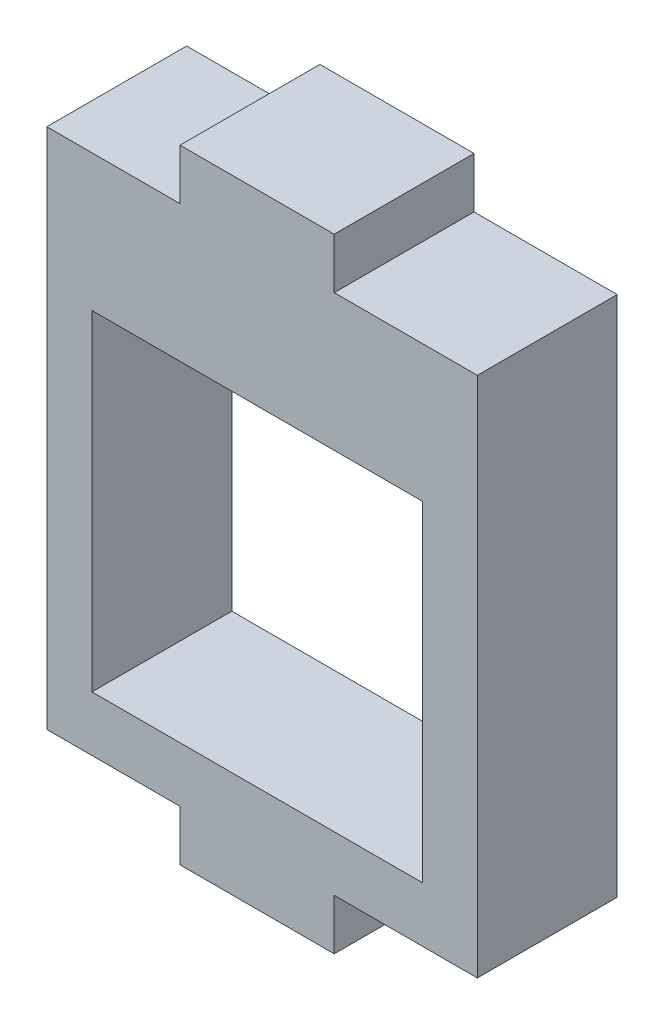
ISO-10303-21;
HEADER;
FILE_DESCRIPTION(('STEP AP214'),'2;1');
FILE_NAME('part.step','',(''),(''),'','','');
FILE_SCHEMA(('AUTOMOTIVE_DESIGN { 1 0 10303 214 1 1 1 1 }'));
ENDSEC;
DATA;
#1=APPLICATION_CONTEXT('core data for automotive mechanical design processes');
#2=APPLICATION_PROTOCOL_DEFINITION('international standard','automotive_design',2000,#1);
#3=PRODUCT_CONTEXT('',#1,'mechanical');
#4=PRODUCT('Part','Part','',(#3));
#5=PRODUCT_RELATED_PRODUCT_CATEGORY('part','',(#4));
#6=PRODUCT_DEFINITION_FORMATION('','',#4);
#7=PRODUCT_DEFINITION_CONTEXT('part definition',#1,'design');
#8=PRODUCT_DEFINITION('design','',#6,#7);
#9=PRODUCT_DEFINITION_SHAPE('','',#8);
#10=(LENGTH_UNIT() NAMED_UNIT(*) SI_UNIT(.MILLI.,.METRE.));
#11=(NAMED_UNIT(*) PLANE_ANGLE_UNIT() SI_UNIT($,.RADIAN.));
#12=(NAMED_UNIT(*) SI_UNIT($,.STERADIAN.) SOLID_ANGLE_UNIT());
#13=UNCERTAINTY_MEASURE_WITH_UNIT(LENGTH_MEASURE(1.E-05),#10,'distance_accuracy_value','');
#14=(GEOMETRIC_REPRESENTATION_CONTEXT(3) GLOBAL_UNCERTAINTY_ASSIGNED_CONTEXT((#13)) GLOBAL_UNIT_ASSIGNED_CONTEXT((#10,
#11,#12)) REPRESENTATION_CONTEXT('',''));
#15=CARTESIAN_POINT('',(0.,0.,0.));
#16=DIRECTION('',(0.,0.,1.));
#17=DIRECTION('',(1.,0.,0.));
#18=AXIS2_PLACEMENT_3D('',#15,#16,#17);
#19=CARTESIAN_POINT('',(2.26470070803342,0.383619426620352,6.35));
#20=DIRECTION('',(0.,1.,0.));
#21=DIRECTION('',(-1.,0.,0.));
#22=AXIS2_PLACEMENT_3D('',#19,#20,#21);
#23=PLANE('',#22);
#24=DIRECTION('',(0.,0.,1.));
#25=VECTOR('',#24,1.);
#26=CARTESIAN_POINT('',(-4.23529929196658,0.383619426620351,0.));
#27=LINE('',#26,#25);
#28=CARTESIAN_POINT('',(-4.23529929196658,0.383619426620351,0.));
#29=VERTEX_POINT('',#28);
#30=CARTESIAN_POINT('',(-4.23529929196658,0.383619426620351,6.35));
#31=VERTEX_POINT('',#30);
#32=EDGE_CURVE('E298',#29,#31,#27,.T.);
#33=ORIENTED_EDGE('',*,*,#32,.F.);
#34=DIRECTION('',(1.,0.,0.));
#35=VECTOR('',#34,1.);
#36=CARTESIAN_POINT('',(2.26470070803342,0.383619426620352,0.));
#37=LINE('',#36,#35);
#38=CARTESIAN_POINT('',(2.26470070803342,0.383619426620352,0.));
#39=VERTEX_POINT('',#38);
#40=EDGE_CURVE('E187',#29,#39,#37,.T.);
#41=ORIENTED_EDGE('',*,*,#40,.T.);
#42=DIRECTION('',(0.,0.,-1.));
#43=VECTOR('',#42,1.);
#44=CARTESIAN_POINT('',(2.26470070803342,0.383619426620352,6.35));
#45=LINE('',#44,#43);
#46=CARTESIAN_POINT('',(2.26470070803342,0.383619426620352,6.35));
#47=VERTEX_POINT('',#46);
#48=EDGE_CURVE('E48',#47,#39,#45,.T.);
#49=ORIENTED_EDGE('',*,*,#48,.F.);
#50=DIRECTION('',(1.,0.,0.));
#51=VECTOR('',#50,1.);
#52=CARTESIAN_POINT('',(2.26470070803342,0.383619426620352,6.35));
#53=LINE('',#52,#51);
#54=EDGE_CURVE('E169',#31,#47,#53,.T.);
#55=ORIENTED_EDGE('',*,*,#54,.F.);
#56=EDGE_LOOP('',(#33,#41,#49,#55));
#57=FACE_BOUND('',#56,.T.);
#58=ADVANCED_FACE('F40',(#57),#23,.F.);
#59=CARTESIAN_POINT('',(-17.2852992919666,0.383619426620351,6.35));
#60=VERTEX_POINT('',#59);
#61=CARTESIAN_POINT('',(-11.2352992919666,0.383619426620351,6.35));
#62=VERTEX_POINT('',#61);
#63=EDGE_CURVE('E61',#60,#62,#53,.T.);
#64=ORIENTED_EDGE('',*,*,#63,.F.);
#65=DIRECTION('',(0.,0.,1.));
#66=VECTOR('',#65,1.);
#67=CARTESIAN_POINT('',(-17.2852992919666,0.383619426620351,-3.65));
#68=LINE('',#67,#66);
#69=CARTESIAN_POINT('',(-17.2852992919666,0.383619426620351,0.));
#70=VERTEX_POINT('',#69);
#71=EDGE_CURVE('E151',#70,#60,#68,.T.);
#72=ORIENTED_EDGE('',*,*,#71,.F.);
#73=CARTESIAN_POINT('',(-11.2352992919666,0.383619426620351,0.));
#74=VERTEX_POINT('',#73);
#75=EDGE_CURVE('E184',#70,#74,#37,.T.);
#76=ORIENTED_EDGE('',*,*,#75,.T.);
#77=DIRECTION('',(0.,0.,1.));
#78=VECTOR('',#77,1.);
#79=CARTESIAN_POINT('',(-11.2352992919666,0.383619426620351,0.));
#80=LINE('',#79,#78);
#81=EDGE_CURVE('E167',#74,#62,#80,.T.);
#82=ORIENTED_EDGE('',*,*,#81,.T.);
#83=EDGE_LOOP('',(#64,#72,#76,#82));
#84=FACE_BOUND('',#83,.T.);
#85=ADVANCED_FACE('F42',(#84),#23,.F.);
#86=CARTESIAN_POINT('',(2.26470070803342,17.8836194266204,6.35));
#87=DIRECTION('',(-1.,0.,0.));
#88=DIRECTION('',(0.,-1.,0.));
#89=AXIS2_PLACEMENT_3D('',#86,#87,#88);
#90=PLANE('',#89);
#91=DIRECTION('',(0.,1.,0.));
#92=VECTOR('',#91,1.);
#93=CARTESIAN_POINT('',(2.26470070803342,17.8836194266204,0.));
#94=LINE('',#93,#92);
#95=CARTESIAN_POINT('',(2.26470070803342,24.0836194266204,0.));
#96=VERTEX_POINT('',#95);
#97=EDGE_CURVE('E186',#39,#96,#94,.T.);
#98=ORIENTED_EDGE('',*,*,#97,.T.);
#99=DIRECTION('',(0.,0.,1.));
#100=VECTOR('',#99,1.);
#101=CARTESIAN_POINT('',(2.26470070803342,24.0836194266204,0.));
#102=LINE('',#101,#100);
#103=CARTESIAN_POINT('',(2.26470070803342,24.0836194266204,6.35));
#104=VERTEX_POINT('',#103);
#105=EDGE_CURVE('E244',#96,#104,#102,.T.);
#106=ORIENTED_EDGE('',*,*,#105,.T.);
#107=DIRECTION('',(0.,1.,0.));
#108=VECTOR('',#107,1.);
#109=CARTESIAN_POINT('',(2.26470070803342,17.8836194266204,6.35));
#110=LINE('',#109,#108);
#111=EDGE_CURVE('E168',#47,#104,#110,.T.);
#112=ORIENTED_EDGE('',*,*,#111,.F.);
#113=ORIENTED_EDGE('',*,*,#48,.T.);
#114=EDGE_LOOP('',(#98,#106,#112,#113));
#115=FACE_BOUND('',#114,.T.);
#116=ADVANCED_FACE('F209',(#115),#90,.F.);
#117=CARTESIAN_POINT('',(-0.235299291966581,2.88361942662035,6.35));
#118=DIRECTION('',(1.,0.,0.));
#119=DIRECTION('',(0.,0.,-1.));
#120=AXIS2_PLACEMENT_3D('',#117,#118,#119);
#121=PLANE('',#120);
#122=DIRECTION('',(0.,-1.,0.));
#123=VECTOR('',#122,1.);
#124=CARTESIAN_POINT('',(-0.235299291966581,2.88361942662035,0.));
#125=LINE('',#124,#123);
#126=CARTESIAN_POINT('',(-0.235299291966581,17.8836194266204,0.));
#127=VERTEX_POINT('',#126);
#128=CARTESIAN_POINT('',(-0.235299291966581,2.88361942662035,0.));
#129=VERTEX_POINT('',#128);
#130=EDGE_CURVE('E189',#127,#129,#125,.T.);
#131=ORIENTED_EDGE('',*,*,#130,.T.);
#132=DIRECTION('',(0.,0.,-1.));
#133=VECTOR('',#132,1.);
#134=CARTESIAN_POINT('',(-0.235299291966581,2.88361942662035,6.35));
#135=LINE('',#134,#133);
#136=CARTESIAN_POINT('',(-0.235299291966581,2.88361942662035,6.35));
#137=VERTEX_POINT('',#136);
#138=EDGE_CURVE('E199',#137,#129,#135,.T.);
#139=ORIENTED_EDGE('',*,*,#138,.F.);
#140=DIRECTION('',(0.,-1.,0.));
#141=VECTOR('',#140,1.);
#142=CARTESIAN_POINT('',(-0.235299291966581,2.88361942662035,6.35));
#143=LINE('',#142,#141);
#144=CARTESIAN_POINT('',(-0.235299291966581,17.8836194266204,6.35));
#145=VERTEX_POINT('',#144);
#146=EDGE_CURVE('E171',#145,#137,#143,.T.);
#147=ORIENTED_EDGE('',*,*,#146,.F.);
#148=DIRECTION('',(0.,0.,-1.));
#149=VECTOR('',#148,1.);
#150=CARTESIAN_POINT('',(-0.235299291966581,17.8836194266204,6.35));
#151=LINE('',#150,#149);
#152=EDGE_CURVE('E202',#145,#127,#151,.T.);
#153=ORIENTED_EDGE('',*,*,#152,.T.);
#154=EDGE_LOOP('',(#131,#139,#147,#153));
#155=FACE_BOUND('',#154,.T.);
#156=ADVANCED_FACE('F276',(#155),#121,.F.);
#157=CARTESIAN_POINT('',(-15.2352992919666,2.88361942662035,6.35));
#158=DIRECTION('',(0.,-1.,0.));
#159=DIRECTION('',(1.,0.,0.));
#160=AXIS2_PLACEMENT_3D('',#157,#158,#159);
#161=PLANE('',#160);
#162=DIRECTION('',(-1.,0.,0.));
#163=VECTOR('',#162,1.);
#164=CARTESIAN_POINT('',(-15.2352992919666,2.88361942662035,0.));
#165=LINE('',#164,#163);
#166=CARTESIAN_POINT('',(-15.2352992919666,2.88361942662035,0.));
#167=VERTEX_POINT('',#166);
#168=EDGE_CURVE('E191',#129,#167,#165,.T.);
#169=ORIENTED_EDGE('',*,*,#168,.T.);
#170=DIRECTION('',(0.,0.,-1.));
#171=VECTOR('',#170,1.);
#172=CARTESIAN_POINT('',(-15.2352992919666,2.88361942662035,6.35));
#173=LINE('',#172,#171);
#174=CARTESIAN_POINT('',(-15.2352992919666,2.88361942662035,6.35));
#175=VERTEX_POINT('',#174);
#176=EDGE_CURVE('E196',#175,#167,#173,.T.);
#177=ORIENTED_EDGE('',*,*,#176,.F.);
#178=DIRECTION('',(-1.,0.,0.));
#179=VECTOR('',#178,1.);
#180=CARTESIAN_POINT('',(-15.2352992919666,2.88361942662035,6.35));
#181=LINE('',#180,#179);
#182=EDGE_CURVE('E179',#137,#175,#181,.T.);
#183=ORIENTED_EDGE('',*,*,#182,.F.);
#184=ORIENTED_EDGE('',*,*,#138,.T.);
#185=EDGE_LOOP('',(#169,#177,#183,#184));
#186=FACE_BOUND('',#185,.T.);
#187=ADVANCED_FACE('F281',(#186),#161,.F.);
#188=CARTESIAN_POINT('',(-15.2352992919666,17.8836194266204,6.35));
#189=DIRECTION('',(-1.,0.,0.));
#190=DIRECTION('',(0.,-1.,0.));
#191=AXIS2_PLACEMENT_3D('',#188,#189,#190);
#192=PLANE('',#191);
#193=DIRECTION('',(0.,1.,0.));
#194=VECTOR('',#193,1.);
#195=CARTESIAN_POINT('',(-15.2352992919666,17.8836194266204,0.));
#196=LINE('',#195,#194);
#197=CARTESIAN_POINT('',(-15.2352992919666,17.8836194266204,0.));
#198=VERTEX_POINT('',#197);
#199=EDGE_CURVE('E173',#167,#198,#196,.T.);
#200=ORIENTED_EDGE('',*,*,#199,.T.);
#201=DIRECTION('',(0.,0.,-1.));
#202=VECTOR('',#201,1.);
#203=CARTESIAN_POINT('',(-15.2352992919666,17.8836194266204,6.35));
#204=LINE('',#203,#202);
#205=CARTESIAN_POINT('',(-15.2352992919666,17.8836194266204,6.35));
#206=VERTEX_POINT('',#205);
#207=EDGE_CURVE('E183',#206,#198,#204,.T.);
#208=ORIENTED_EDGE('',*,*,#207,.F.);
#209=DIRECTION('',(0.,1.,0.));
#210=VECTOR('',#209,1.);
#211=CARTESIAN_POINT('',(-15.2352992919666,17.8836194266204,6.35));
#212=LINE('',#211,#210);
#213=EDGE_CURVE('E181',#175,#206,#212,.T.);
#214=ORIENTED_EDGE('',*,*,#213,.F.);
#215=ORIENTED_EDGE('',*,*,#176,.T.);
#216=EDGE_LOOP('',(#200,#208,#214,#215));
#217=FACE_BOUND('',#216,.T.);
#218=ADVANCED_FACE('F283',(#217),#192,.F.);
#219=CARTESIAN_POINT('',(0.,0.,6.35));
#220=DIRECTION('',(0.,0.,-1.));
#221=DIRECTION('',(-1.,0.,0.));
#222=AXIS2_PLACEMENT_3D('',#219,#220,#221);
#223=PLANE('',#222);
#224=DIRECTION('',(-1.,0.,0.));
#225=VECTOR('',#224,1.);
#226=CARTESIAN_POINT('',(-17.7352992919666,24.0836194266204,6.35));
#227=LINE('',#226,#225);
#228=CARTESIAN_POINT('',(-11.2352992919666,24.0836194266204,6.35));
#229=VERTEX_POINT('',#228);
#230=CARTESIAN_POINT('',(-17.2852992919666,24.0836194266204,6.35));
#231=VERTEX_POINT('',#230);
#232=EDGE_CURVE('E163',#229,#231,#227,.T.);
#233=ORIENTED_EDGE('',*,*,#232,.T.);
#234=DIRECTION('',(0.,1.,0.));
#235=VECTOR('',#234,1.);
#236=CARTESIAN_POINT('',(-17.2852992919666,24.0836194266204,6.35));
#237=LINE('',#236,#235);
#238=EDGE_CURVE('E54',#60,#231,#237,.T.);
#239=ORIENTED_EDGE('',*,*,#238,.F.);
#240=ORIENTED_EDGE('',*,*,#63,.T.);
#241=DIRECTION('',(0.,-1.,0.));
#242=VECTOR('',#241,1.);
#243=CARTESIAN_POINT('',(-11.2352992919666,0.383619426620351,6.35));
#244=LINE('',#243,#242);
#245=CARTESIAN_POINT('',(-11.2352992919666,-1.91638057337965,6.35));
#246=VERTEX_POINT('',#245);
#247=EDGE_CURVE('E312',#62,#246,#244,.T.);
#248=ORIENTED_EDGE('',*,*,#247,.T.);
#249=DIRECTION('',(1.,0.,0.));
#250=VECTOR('',#249,1.);
#251=CARTESIAN_POINT('',(-11.2352992919666,-1.91638057337965,6.35));
#252=LINE('',#251,#250);
#253=CARTESIAN_POINT('',(-4.23529929196658,-1.91638057337965,6.35));
#254=VERTEX_POINT('',#253);
#255=EDGE_CURVE('E309',#246,#254,#252,.T.);
#256=ORIENTED_EDGE('',*,*,#255,.T.);
#257=DIRECTION('',(0.,1.,0.));
#258=VECTOR('',#257,1.);
#259=CARTESIAN_POINT('',(-4.23529929196658,0.383619426620351,6.35));
#260=LINE('',#259,#258);
#261=EDGE_CURVE('E306',#254,#31,#260,.T.);
#262=ORIENTED_EDGE('',*,*,#261,.T.);
#263=ORIENTED_EDGE('',*,*,#54,.T.);
#264=ORIENTED_EDGE('',*,*,#111,.T.);
#265=DIRECTION('',(-1.,0.,0.));
#266=VECTOR('',#265,1.);
#267=CARTESIAN_POINT('',(-4.23529929196658,24.0836194266204,6.35));
#268=LINE('',#267,#266);
#269=CARTESIAN_POINT('',(-4.23529929196658,24.0836194266204,6.35));
#270=VERTEX_POINT('',#269);
#271=EDGE_CURVE('E245',#104,#270,#268,.T.);
#272=ORIENTED_EDGE('',*,*,#271,.T.);
#273=DIRECTION('',(0.,1.,0.));
#274=VECTOR('',#273,1.);
#275=CARTESIAN_POINT('',(-4.23529929196658,24.0836194266204,6.35));
#276=LINE('',#275,#274);
#277=CARTESIAN_POINT('',(-4.23529929196658,26.3836194266203,6.35));
#278=VERTEX_POINT('',#277);
#279=EDGE_CURVE('E248',#270,#278,#276,.T.);
#280=ORIENTED_EDGE('',*,*,#279,.T.);
#281=DIRECTION('',(-1.,0.,0.));
#282=VECTOR('',#281,1.);
#283=CARTESIAN_POINT('',(-11.2352992919666,26.3836194266203,6.35));
#284=LINE('',#283,#282);
#285=CARTESIAN_POINT('',(-11.2352992919666,26.3836194266203,6.35));
#286=VERTEX_POINT('',#285);
#287=EDGE_CURVE('E251',#278,#286,#284,.T.);
#288=ORIENTED_EDGE('',*,*,#287,.T.);
#289=DIRECTION('',(0.,-1.,0.));
#290=VECTOR('',#289,1.);
#291=CARTESIAN_POINT('',(-11.2352992919666,24.0836194266204,6.35));
#292=LINE('',#291,#290);
#293=EDGE_CURVE('E230',#286,#229,#292,.T.);
#294=ORIENTED_EDGE('',*,*,#293,.T.);
#295=EDGE_LOOP('',(#233,#239,#240,#248,#256,#262,#263,#264,#272,#280,#288,#294));
#296=FACE_BOUND('',#295,.T.);
#297=ORIENTED_EDGE('',*,*,#213,.T.);
#298=DIRECTION('',(1.,0.,0.));
#299=VECTOR('',#298,1.);
#300=CARTESIAN_POINT('',(-17.7352992919666,17.8836194266204,6.35));
#301=LINE('',#300,#299);
#302=EDGE_CURVE('E263',#206,#145,#301,.T.);
#303=ORIENTED_EDGE('',*,*,#302,.T.);
#304=ORIENTED_EDGE('',*,*,#146,.T.);
#305=ORIENTED_EDGE('',*,*,#182,.T.);
#306=EDGE_LOOP('',(#297,#303,#304,#305));
#307=FACE_BOUND('',#306,.T.);
#308=ADVANCED_FACE('F159',(#296,#307),#223,.F.);
#309=CARTESIAN_POINT('',(0.,0.,0.));
#310=DIRECTION('',(0.,0.,-1.));
#311=DIRECTION('',(-1.,0.,0.));
#312=AXIS2_PLACEMENT_3D('',#309,#310,#311);
#313=PLANE('',#312);
#314=DIRECTION('',(0.,-1.,0.));
#315=VECTOR('',#314,1.);
#316=CARTESIAN_POINT('',(-17.2852992919666,0.,0.));
#317=LINE('',#316,#315);
#318=CARTESIAN_POINT('',(-17.2852992919666,24.0836194266204,0.));
#319=VERTEX_POINT('',#318);
#320=EDGE_CURVE('E154',#319,#70,#317,.T.);
#321=ORIENTED_EDGE('',*,*,#320,.F.);
#322=DIRECTION('',(-1.,0.,0.));
#323=VECTOR('',#322,1.);
#324=CARTESIAN_POINT('',(-17.7352992919666,24.0836194266204,0.));
#325=LINE('',#324,#323);
#326=CARTESIAN_POINT('',(-11.2352992919666,24.0836194266204,0.));
#327=VERTEX_POINT('',#326);
#328=EDGE_CURVE('E241',#327,#319,#325,.T.);
#329=ORIENTED_EDGE('',*,*,#328,.F.);
#330=DIRECTION('',(0.,-1.,0.));
#331=VECTOR('',#330,1.);
#332=CARTESIAN_POINT('',(-11.2352992919666,24.0836194266204,0.));
#333=LINE('',#332,#331);
#334=CARTESIAN_POINT('',(-11.2352992919666,26.3836194266203,0.));
#335=VERTEX_POINT('',#334);
#336=EDGE_CURVE('E238',#335,#327,#333,.T.);
#337=ORIENTED_EDGE('',*,*,#336,.F.);
#338=DIRECTION('',(-1.,0.,0.));
#339=VECTOR('',#338,1.);
#340=CARTESIAN_POINT('',(-11.2352992919666,26.3836194266203,0.));
#341=LINE('',#340,#339);
#342=CARTESIAN_POINT('',(-4.23529929196658,26.3836194266203,0.));
#343=VERTEX_POINT('',#342);
#344=EDGE_CURVE('E228',#343,#335,#341,.T.);
#345=ORIENTED_EDGE('',*,*,#344,.F.);
#346=DIRECTION('',(0.,1.,0.));
#347=VECTOR('',#346,1.);
#348=CARTESIAN_POINT('',(-4.23529929196658,24.0836194266204,0.));
#349=LINE('',#348,#347);
#350=CARTESIAN_POINT('',(-4.23529929196658,24.0836194266204,0.));
#351=VERTEX_POINT('',#350);
#352=EDGE_CURVE('E225',#351,#343,#349,.T.);
#353=ORIENTED_EDGE('',*,*,#352,.F.);
#354=DIRECTION('',(-1.,0.,0.));
#355=VECTOR('',#354,1.);
#356=CARTESIAN_POINT('',(-4.23529929196658,24.0836194266204,0.));
#357=LINE('',#356,#355);
#358=EDGE_CURVE('E222',#96,#351,#357,.T.);
#359=ORIENTED_EDGE('',*,*,#358,.F.);
#360=ORIENTED_EDGE('',*,*,#97,.F.);
#361=ORIENTED_EDGE('',*,*,#40,.F.);
#362=DIRECTION('',(0.,1.,0.));
#363=VECTOR('',#362,1.);
#364=CARTESIAN_POINT('',(-4.23529929196658,0.383619426620351,0.));
#365=LINE('',#364,#363);
#366=CARTESIAN_POINT('',(-4.23529929196658,-1.91638057337965,0.));
#367=VERTEX_POINT('',#366);
#368=EDGE_CURVE('E314',#367,#29,#365,.T.);
#369=ORIENTED_EDGE('',*,*,#368,.F.);
#370=DIRECTION('',(1.,0.,0.));
#371=VECTOR('',#370,1.);
#372=CARTESIAN_POINT('',(-11.2352992919666,-1.91638057337965,0.));
#373=LINE('',#372,#371);
#374=CARTESIAN_POINT('',(-11.2352992919666,-1.91638057337965,0.));
#375=VERTEX_POINT('',#374);
#376=EDGE_CURVE('E316',#375,#367,#373,.T.);
#377=ORIENTED_EDGE('',*,*,#376,.F.);
#378=DIRECTION('',(0.,-1.,0.));
#379=VECTOR('',#378,1.);
#380=CARTESIAN_POINT('',(-11.2352992919666,0.383619426620351,0.));
#381=LINE('',#380,#379);
#382=EDGE_CURVE('E308',#74,#375,#381,.T.);
#383=ORIENTED_EDGE('',*,*,#382,.F.);
#384=ORIENTED_EDGE('',*,*,#75,.F.);
#385=EDGE_LOOP('',(#321,#329,#337,#345,#353,#359,#360,#361,#369,#377,#383,#384));
#386=FACE_BOUND('',#385,.T.);
#387=DIRECTION('',(1.,0.,0.));
#388=VECTOR('',#387,1.);
#389=CARTESIAN_POINT('',(-17.7352992919666,17.8836194266204,0.));
#390=LINE('',#389,#388);
#391=EDGE_CURVE('E175',#198,#127,#390,.T.);
#392=ORIENTED_EDGE('',*,*,#391,.F.);
#393=ORIENTED_EDGE('',*,*,#199,.F.);
#394=ORIENTED_EDGE('',*,*,#168,.F.);
#395=ORIENTED_EDGE('',*,*,#130,.F.);
#396=EDGE_LOOP('',(#392,#393,#394,#395));
#397=FACE_BOUND('',#396,.T.);
#398=ADVANCED_FACE('F217',(#386,#397),#313,.T.);
#399=CARTESIAN_POINT('',(-17.7352992919666,17.8836194266204,6.35));
#400=DIRECTION('',(0.,1.,0.));
#401=DIRECTION('',(0.,0.,1.));
#402=AXIS2_PLACEMENT_3D('',#399,#400,#401);
#403=PLANE('',#402);
#404=ORIENTED_EDGE('',*,*,#391,.T.);
#405=ORIENTED_EDGE('',*,*,#152,.F.);
#406=ORIENTED_EDGE('',*,*,#302,.F.);
#407=ORIENTED_EDGE('',*,*,#207,.T.);
#408=EDGE_LOOP('',(#404,#405,#406,#407));
#409=FACE_BOUND('',#408,.T.);
#410=ADVANCED_FACE('F270',(#409),#403,.F.);
#411=CARTESIAN_POINT('',(-17.7352992919666,24.0836194266204,0.));
#412=DIRECTION('',(0.,1.,0.));
#413=DIRECTION('',(0.,0.,1.));
#414=AXIS2_PLACEMENT_3D('',#411,#412,#413);
#415=PLANE('',#414);
#416=DIRECTION('',(0.,0.,-1.));
#417=VECTOR('',#416,1.);
#418=CARTESIAN_POINT('',(-17.2852992919666,24.0836194266204,0.));
#419=LINE('',#418,#417);
#420=EDGE_CURVE('E11',#231,#319,#419,.T.);
#421=ORIENTED_EDGE('',*,*,#420,.F.);
#422=ORIENTED_EDGE('',*,*,#232,.F.);
#423=DIRECTION('',(0.,0.,1.));
#424=VECTOR('',#423,1.);
#425=CARTESIAN_POINT('',(-11.2352992919666,24.0836194266204,0.));
#426=LINE('',#425,#424);
#427=EDGE_CURVE('E255',#327,#229,#426,.T.);
#428=ORIENTED_EDGE('',*,*,#427,.F.);
#429=ORIENTED_EDGE('',*,*,#328,.T.);
#430=EDGE_LOOP('',(#421,#422,#428,#429));
#431=FACE_BOUND('',#430,.T.);
#432=ADVANCED_FACE('F340',(#431),#415,.T.);
#433=CARTESIAN_POINT('',(-11.2352992919666,24.0836194266204,0.));
#434=DIRECTION('',(-1.,0.,0.));
#435=DIRECTION('',(0.,0.,1.));
#436=AXIS2_PLACEMENT_3D('',#433,#434,#435);
#437=PLANE('',#436);
#438=ORIENTED_EDGE('',*,*,#293,.F.);
#439=DIRECTION('',(0.,0.,1.));
#440=VECTOR('',#439,1.);
#441=CARTESIAN_POINT('',(-11.2352992919666,26.3836194266203,0.));
#442=LINE('',#441,#440);
#443=EDGE_CURVE('E257',#335,#286,#442,.T.);
#444=ORIENTED_EDGE('',*,*,#443,.F.);
#445=ORIENTED_EDGE('',*,*,#336,.T.);
#446=ORIENTED_EDGE('',*,*,#427,.T.);
#447=EDGE_LOOP('',(#438,#444,#445,#446));
#448=FACE_BOUND('',#447,.T.);
#449=ADVANCED_FACE('F343',(#448),#437,.T.);
#450=CARTESIAN_POINT('',(-11.2352992919666,26.3836194266203,0.));
#451=DIRECTION('',(0.,1.,0.));
#452=DIRECTION('',(0.,0.,1.));
#453=AXIS2_PLACEMENT_3D('',#450,#451,#452);
#454=PLANE('',#453);
#455=ORIENTED_EDGE('',*,*,#287,.F.);
#456=DIRECTION('',(0.,0.,1.));
#457=VECTOR('',#456,1.);
#458=CARTESIAN_POINT('',(-4.23529929196658,26.3836194266203,0.));
#459=LINE('',#458,#457);
#460=EDGE_CURVE('E259',#343,#278,#459,.T.);
#461=ORIENTED_EDGE('',*,*,#460,.F.);
#462=ORIENTED_EDGE('',*,*,#344,.T.);
#463=ORIENTED_EDGE('',*,*,#443,.T.);
#464=EDGE_LOOP('',(#455,#461,#462,#463));
#465=FACE_BOUND('',#464,.T.);
#466=ADVANCED_FACE('F347',(#465),#454,.T.);
#467=CARTESIAN_POINT('',(-4.23529929196658,24.0836194266204,0.));
#468=DIRECTION('',(1.,0.,0.));
#469=DIRECTION('',(0.,0.,-1.));
#470=AXIS2_PLACEMENT_3D('',#467,#468,#469);
#471=PLANE('',#470);
#472=ORIENTED_EDGE('',*,*,#279,.F.);
#473=DIRECTION('',(0.,0.,1.));
#474=VECTOR('',#473,1.);
#475=CARTESIAN_POINT('',(-4.23529929196658,24.0836194266204,0.));
#476=LINE('',#475,#474);
#477=EDGE_CURVE('E261',#351,#270,#476,.T.);
#478=ORIENTED_EDGE('',*,*,#477,.F.);
#479=ORIENTED_EDGE('',*,*,#352,.T.);
#480=ORIENTED_EDGE('',*,*,#460,.T.);
#481=EDGE_LOOP('',(#472,#478,#479,#480));
#482=FACE_BOUND('',#481,.T.);
#483=ADVANCED_FACE('F351',(#482),#471,.T.);
#484=CARTESIAN_POINT('',(-4.23529929196658,24.0836194266204,0.));
#485=DIRECTION('',(0.,1.,0.));
#486=DIRECTION('',(0.,0.,1.));
#487=AXIS2_PLACEMENT_3D('',#484,#485,#486);
#488=PLANE('',#487);
#489=ORIENTED_EDGE('',*,*,#271,.F.);
#490=ORIENTED_EDGE('',*,*,#105,.F.);
#491=ORIENTED_EDGE('',*,*,#358,.T.);
#492=ORIENTED_EDGE('',*,*,#477,.T.);
#493=EDGE_LOOP('',(#489,#490,#491,#492));
#494=FACE_BOUND('',#493,.T.);
#495=ADVANCED_FACE('F336',(#494),#488,.T.);
#496=CARTESIAN_POINT('',(-11.2352992919666,0.383619426620351,0.));
#497=DIRECTION('',(-1.,0.,0.));
#498=DIRECTION('',(0.,0.,1.));
#499=AXIS2_PLACEMENT_3D('',#496,#497,#498);
#500=PLANE('',#499);
#501=ORIENTED_EDGE('',*,*,#247,.F.);
#502=ORIENTED_EDGE('',*,*,#81,.F.);
#503=ORIENTED_EDGE('',*,*,#382,.T.);
#504=DIRECTION('',(0.,0.,1.));
#505=VECTOR('',#504,1.);
#506=CARTESIAN_POINT('',(-11.2352992919666,-1.91638057337965,0.));
#507=LINE('',#506,#505);
#508=EDGE_CURVE('E233',#375,#246,#507,.T.);
#509=ORIENTED_EDGE('',*,*,#508,.T.);
#510=EDGE_LOOP('',(#501,#502,#503,#509));
#511=FACE_BOUND('',#510,.T.);
#512=ADVANCED_FACE('F323',(#511),#500,.T.);
#513=CARTESIAN_POINT('',(-4.23529929196658,0.383619426620351,0.));
#514=DIRECTION('',(1.,0.,0.));
#515=DIRECTION('',(0.,0.,-1.));
#516=AXIS2_PLACEMENT_3D('',#513,#514,#515);
#517=PLANE('',#516);
#518=ORIENTED_EDGE('',*,*,#261,.F.);
#519=DIRECTION('',(0.,0.,1.));
#520=VECTOR('',#519,1.);
#521=CARTESIAN_POINT('',(-4.23529929196658,-1.91638057337965,0.));
#522=LINE('',#521,#520);
#523=EDGE_CURVE('E302',#367,#254,#522,.T.);
#524=ORIENTED_EDGE('',*,*,#523,.F.);
#525=ORIENTED_EDGE('',*,*,#368,.T.);
#526=ORIENTED_EDGE('',*,*,#32,.T.);
#527=EDGE_LOOP('',(#518,#524,#525,#526));
#528=FACE_BOUND('',#527,.T.);
#529=ADVANCED_FACE('F328',(#528),#517,.T.);
#530=CARTESIAN_POINT('',(-11.2352992919666,-1.91638057337965,0.));
#531=DIRECTION('',(0.,-1.,0.));
#532=DIRECTION('',(0.,0.,-1.));
#533=AXIS2_PLACEMENT_3D('',#530,#531,#532);
#534=PLANE('',#533);
#535=ORIENTED_EDGE('',*,*,#255,.F.);
#536=ORIENTED_EDGE('',*,*,#508,.F.);
#537=ORIENTED_EDGE('',*,*,#376,.T.);
#538=ORIENTED_EDGE('',*,*,#523,.T.);
#539=EDGE_LOOP('',(#535,#536,#537,#538));
#540=FACE_BOUND('',#539,.T.);
#541=ADVANCED_FACE('F327',(#540),#534,.T.);
#542=CARTESIAN_POINT('',(-17.2852992919666,24.0836194266204,-3.65));
#543=DIRECTION('',(1.,0.,0.));
#544=DIRECTION('',(0.,1.,0.));
#545=AXIS2_PLACEMENT_3D('',#542,#543,#544);
#546=PLANE('',#545);
#547=ORIENTED_EDGE('',*,*,#320,.T.);
#548=ORIENTED_EDGE('',*,*,#71,.T.);
#549=ORIENTED_EDGE('',*,*,#238,.T.);
#550=ORIENTED_EDGE('',*,*,#420,.T.);
#551=EDGE_LOOP('',(#547,#548,#549,#550));
#552=FACE_BOUND('',#551,.T.);
#553=ADVANCED_FACE('F152',(#552),#546,.F.);
#554=CLOSED_SHELL('',(#58,#85,#116,#156,#187,#218,#308,#398,#410,#432,#449,#466,#483,#495,#512,
#529,#541,#553));
#555=MANIFOLD_SOLID_BREP('B2',#554);
#556=ADVANCED_BREP_SHAPE_REPRESENTATION('',(#18,#555),#14);
#557=SHAPE_DEFINITION_REPRESENTATION(#9,#556);
ENDSEC;
END-ISO-10303-21;
